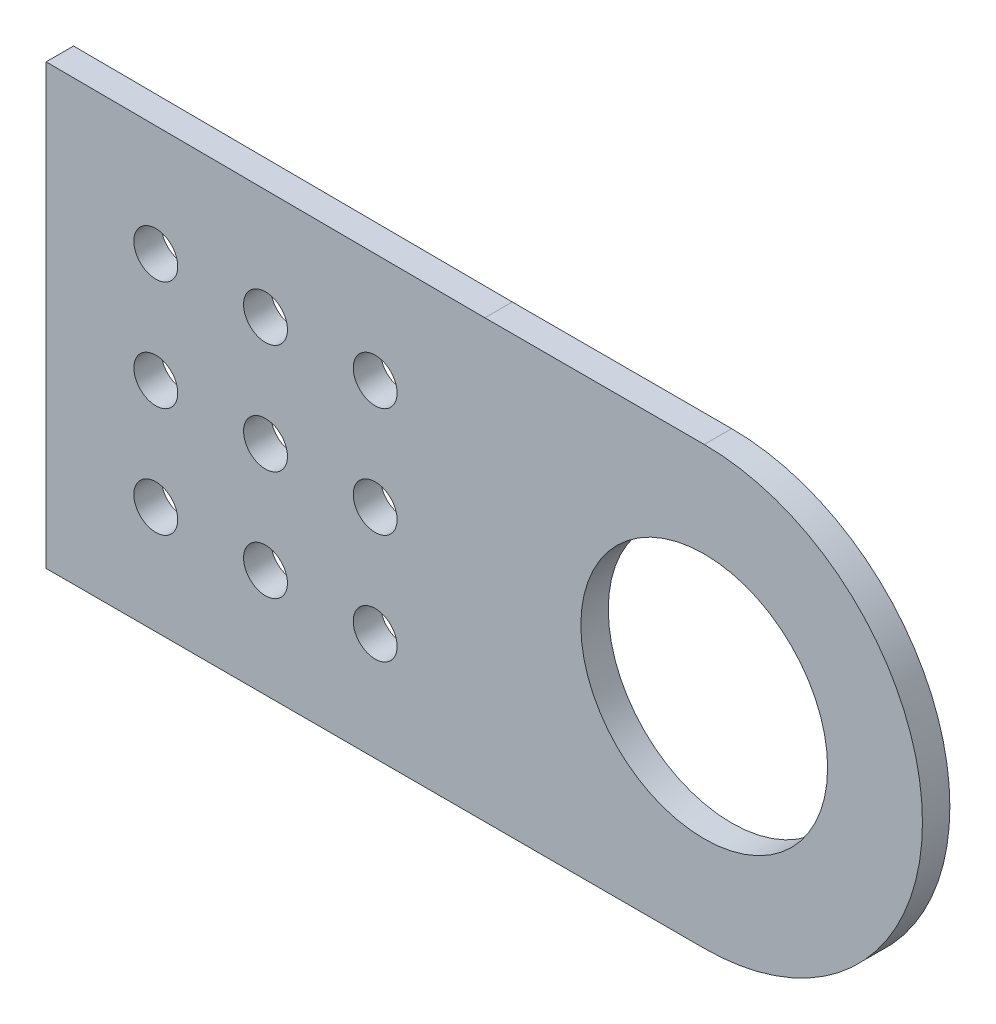
ISO-10303-21;
HEADER;
FILE_DESCRIPTION(('STEP AP214'),'2;1');
FILE_NAME('part.step','',(''),(''),'','','');
FILE_SCHEMA(('AUTOMOTIVE_DESIGN { 1 0 10303 214 1 1 1 1 }'));
ENDSEC;
DATA;
#1=APPLICATION_CONTEXT('core data for automotive mechanical design processes');
#2=APPLICATION_PROTOCOL_DEFINITION('international standard','automotive_design',2000,#1);
#3=PRODUCT_CONTEXT('',#1,'mechanical');
#4=PRODUCT('Part','Part','',(#3));
#5=PRODUCT_RELATED_PRODUCT_CATEGORY('part','',(#4));
#6=PRODUCT_DEFINITION_FORMATION('','',#4);
#7=PRODUCT_DEFINITION_CONTEXT('part definition',#1,'design');
#8=PRODUCT_DEFINITION('design','',#6,#7);
#9=PRODUCT_DEFINITION_SHAPE('','',#8);
#10=(LENGTH_UNIT() NAMED_UNIT(*) SI_UNIT(.MILLI.,.METRE.));
#11=(NAMED_UNIT(*) PLANE_ANGLE_UNIT() SI_UNIT($,.RADIAN.));
#12=(NAMED_UNIT(*) SI_UNIT($,.STERADIAN.) SOLID_ANGLE_UNIT());
#13=UNCERTAINTY_MEASURE_WITH_UNIT(LENGTH_MEASURE(1.E-05),#10,'distance_accuracy_value','');
#14=(GEOMETRIC_REPRESENTATION_CONTEXT(3) GLOBAL_UNCERTAINTY_ASSIGNED_CONTEXT((#13)) GLOBAL_UNIT_ASSIGNED_CONTEXT((#10,
#11,#12)) REPRESENTATION_CONTEXT('',''));
#15=CARTESIAN_POINT('',(0.,0.,0.));
#16=DIRECTION('',(0.,0.,1.));
#17=DIRECTION('',(1.,0.,0.));
#18=AXIS2_PLACEMENT_3D('',#15,#16,#17);
#19=CARTESIAN_POINT('',(76.2000000000003,25.2672028725198,3.175));
#20=DIRECTION('',(0.,0.,1.));
#21=DIRECTION('',(1.,0.,0.));
#22=AXIS2_PLACEMENT_3D('',#19,#20,#21);
#23=PLANE('',#22);
#24=CARTESIAN_POINT('',(12.7,12.5006307363727,3.175));
#25=DIRECTION('',(0.,0.,1.));
#26=DIRECTION('',(1.,0.,0.));
#27=AXIS2_PLACEMENT_3D('',#24,#25,#26);
#28=CIRCLE('',#27,2.54);
#29=CARTESIAN_POINT('',(15.24,12.5006307363727,3.175));
#30=VERTEX_POINT('',#29);
#31=EDGE_CURVE('E204',#30,#30,#28,.T.);
#32=ORIENTED_EDGE('',*,*,#31,.F.);
#33=EDGE_LOOP('',(#32));
#34=FACE_BOUND('',#33,.T.);
#35=CARTESIAN_POINT('',(38.1,12.5006307363727,3.175));
#36=DIRECTION('',(0.,0.,1.));
#37=DIRECTION('',(1.,0.,0.));
#38=AXIS2_PLACEMENT_3D('',#35,#36,#37);
#39=CIRCLE('',#38,2.54);
#40=CARTESIAN_POINT('',(40.64,12.5006307363727,3.175));
#41=VERTEX_POINT('',#40);
#42=EDGE_CURVE('E216',#41,#41,#39,.T.);
#43=ORIENTED_EDGE('',*,*,#42,.F.);
#44=EDGE_LOOP('',(#43));
#45=FACE_BOUND('',#44,.T.);
#46=CARTESIAN_POINT('',(38.1,25.2006307363727,3.175));
#47=DIRECTION('',(0.,0.,1.));
#48=DIRECTION('',(1.,0.,0.));
#49=AXIS2_PLACEMENT_3D('',#46,#47,#48);
#50=CIRCLE('',#49,2.54);
#51=CARTESIAN_POINT('',(40.64,25.2006307363727,3.175));
#52=VERTEX_POINT('',#51);
#53=EDGE_CURVE('E228',#52,#52,#50,.T.);
#54=ORIENTED_EDGE('',*,*,#53,.F.);
#55=EDGE_LOOP('',(#54));
#56=FACE_BOUND('',#55,.T.);
#57=CARTESIAN_POINT('',(38.1,37.9006307363727,3.175));
#58=DIRECTION('',(0.,0.,1.));
#59=DIRECTION('',(1.,0.,0.));
#60=AXIS2_PLACEMENT_3D('',#57,#58,#59);
#61=CIRCLE('',#60,2.54);
#62=CARTESIAN_POINT('',(40.64,37.9006307363727,3.175));
#63=VERTEX_POINT('',#62);
#64=EDGE_CURVE('E240',#63,#63,#61,.T.);
#65=ORIENTED_EDGE('',*,*,#64,.F.);
#66=EDGE_LOOP('',(#65));
#67=FACE_BOUND('',#66,.T.);
#68=CARTESIAN_POINT('',(12.7,37.9006307363727,3.175));
#69=DIRECTION('',(0.,0.,1.));
#70=DIRECTION('',(1.,0.,0.));
#71=AXIS2_PLACEMENT_3D('',#68,#69,#70);
#72=CIRCLE('',#71,2.54);
#73=CARTESIAN_POINT('',(15.24,37.9006307363727,3.175));
#74=VERTEX_POINT('',#73);
#75=EDGE_CURVE('E120',#74,#74,#72,.T.);
#76=ORIENTED_EDGE('',*,*,#75,.F.);
#77=EDGE_LOOP('',(#76));
#78=FACE_BOUND('',#77,.T.);
#79=DIRECTION('',(1.,0.,0.));
#80=VECTOR('',#79,1.);
#81=CARTESIAN_POINT('',(0.,0.,3.175));
#82=LINE('',#81,#80);
#83=CARTESIAN_POINT('',(0.,0.,3.175));
#84=VERTEX_POINT('',#83);
#85=CARTESIAN_POINT('',(76.2000000000003,0.,3.175));
#86=VERTEX_POINT('',#85);
#87=EDGE_CURVE('E125',#84,#86,#82,.T.);
#88=ORIENTED_EDGE('',*,*,#87,.T.);
#89=CARTESIAN_POINT('',(76.2000000000003,25.2672028725198,3.175));
#90=DIRECTION('',(0.,0.,1.));
#91=DIRECTION('',(1.,0.,0.));
#92=AXIS2_PLACEMENT_3D('',#89,#90,#91);
#93=CIRCLE('',#92,25.2672028725198);
#94=CARTESIAN_POINT('',(76.2000000000003,50.5344057450396,3.175));
#95=VERTEX_POINT('',#94);
#96=EDGE_CURVE('E92',#86,#95,#93,.T.);
#97=ORIENTED_EDGE('',*,*,#96,.T.);
#98=DIRECTION('',(-1.,0.,0.));
#99=VECTOR('',#98,1.);
#100=CARTESIAN_POINT('',(50.7999999999998,50.5344057450396,3.175));
#101=LINE('',#100,#99);
#102=CARTESIAN_POINT('',(50.7999999999998,50.5344057450396,3.175));
#103=VERTEX_POINT('',#102);
#104=EDGE_CURVE('E96',#95,#103,#101,.T.);
#105=ORIENTED_EDGE('',*,*,#104,.T.);
#106=DIRECTION('',(-0.999986333068121,0.00522816191145203,0.));
#107=VECTOR('',#106,1.);
#108=CARTESIAN_POINT('',(0.,50.8,3.175));
#109=LINE('',#108,#107);
#110=CARTESIAN_POINT('',(0.,50.8,3.175));
#111=VERTEX_POINT('',#110);
#112=EDGE_CURVE('E100',#103,#111,#109,.T.);
#113=ORIENTED_EDGE('',*,*,#112,.T.);
#114=DIRECTION('',(0.,-1.,0.));
#115=VECTOR('',#114,1.);
#116=CARTESIAN_POINT('',(0.,0.,3.175));
#117=LINE('',#116,#115);
#118=EDGE_CURVE('E58',#111,#84,#117,.T.);
#119=ORIENTED_EDGE('',*,*,#118,.T.);
#120=EDGE_LOOP('',(#88,#97,#105,#113,#119));
#121=FACE_BOUND('',#120,.T.);
#122=CARTESIAN_POINT('',(25.4,37.9006307363727,3.175));
#123=DIRECTION('',(0.,0.,1.));
#124=DIRECTION('',(1.,0.,0.));
#125=AXIS2_PLACEMENT_3D('',#122,#123,#124);
#126=CIRCLE('',#125,2.54);
#127=CARTESIAN_POINT('',(27.94,37.9006307363727,3.175));
#128=VERTEX_POINT('',#127);
#129=EDGE_CURVE('E246',#128,#128,#126,.T.);
#130=ORIENTED_EDGE('',*,*,#129,.F.);
#131=EDGE_LOOP('',(#130));
#132=FACE_BOUND('',#131,.T.);
#133=CARTESIAN_POINT('',(25.4,25.2006307363727,3.175));
#134=DIRECTION('',(0.,0.,1.));
#135=DIRECTION('',(1.,0.,0.));
#136=AXIS2_PLACEMENT_3D('',#133,#134,#135);
#137=CIRCLE('',#136,2.54);
#138=CARTESIAN_POINT('',(27.94,25.2006307363727,3.175));
#139=VERTEX_POINT('',#138);
#140=EDGE_CURVE('E234',#139,#139,#137,.T.);
#141=ORIENTED_EDGE('',*,*,#140,.F.);
#142=EDGE_LOOP('',(#141));
#143=FACE_BOUND('',#142,.T.);
#144=CARTESIAN_POINT('',(25.4,12.5006307363727,3.175));
#145=DIRECTION('',(0.,0.,1.));
#146=DIRECTION('',(1.,0.,0.));
#147=AXIS2_PLACEMENT_3D('',#144,#145,#146);
#148=CIRCLE('',#147,2.54);
#149=CARTESIAN_POINT('',(27.94,12.5006307363727,3.175));
#150=VERTEX_POINT('',#149);
#151=EDGE_CURVE('E222',#150,#150,#148,.T.);
#152=ORIENTED_EDGE('',*,*,#151,.F.);
#153=EDGE_LOOP('',(#152));
#154=FACE_BOUND('',#153,.T.);
#155=CARTESIAN_POINT('',(12.7,25.2006307363727,3.175));
#156=DIRECTION('',(0.,0.,1.));
#157=DIRECTION('',(1.,0.,0.));
#158=AXIS2_PLACEMENT_3D('',#155,#156,#157);
#159=CIRCLE('',#158,2.54);
#160=CARTESIAN_POINT('',(15.24,25.2006307363727,3.175));
#161=VERTEX_POINT('',#160);
#162=EDGE_CURVE('E210',#161,#161,#159,.T.);
#163=ORIENTED_EDGE('',*,*,#162,.F.);
#164=EDGE_LOOP('',(#163));
#165=FACE_BOUND('',#164,.T.);
#166=CARTESIAN_POINT('',(76.2000000000003,25.2672028725198,3.175));
#167=DIRECTION('',(0.,0.,1.));
#168=DIRECTION('',(1.,0.,0.));
#169=AXIS2_PLACEMENT_3D('',#166,#167,#168);
#170=CIRCLE('',#169,14.2875);
#171=CARTESIAN_POINT('',(90.4875000000003,25.2672028725198,3.175));
#172=VERTEX_POINT('',#171);
#173=EDGE_CURVE('E195',#172,#172,#170,.T.);
#174=ORIENTED_EDGE('',*,*,#173,.F.);
#175=EDGE_LOOP('',(#174));
#176=FACE_BOUND('',#175,.T.);
#177=ADVANCED_FACE('F41',(#34,#45,#56,#67,#78,#121,#132,#143,#154,#165,#176),#23,.T.);
#178=CARTESIAN_POINT('',(76.2000000000003,25.2672028725198,0.));
#179=DIRECTION('',(0.,0.,1.));
#180=DIRECTION('',(1.,0.,0.));
#181=AXIS2_PLACEMENT_3D('',#178,#179,#180);
#182=PLANE('',#181);
#183=DIRECTION('',(1.,0.,0.));
#184=VECTOR('',#183,1.);
#185=CARTESIAN_POINT('',(0.,0.,0.));
#186=LINE('',#185,#184);
#187=CARTESIAN_POINT('',(0.,0.,0.));
#188=VERTEX_POINT('',#187);
#189=CARTESIAN_POINT('',(76.2000000000003,0.,0.));
#190=VERTEX_POINT('',#189);
#191=EDGE_CURVE('E116',#188,#190,#186,.T.);
#192=ORIENTED_EDGE('',*,*,#191,.F.);
#193=DIRECTION('',(0.,-1.,0.));
#194=VECTOR('',#193,1.);
#195=CARTESIAN_POINT('',(0.,0.,0.));
#196=LINE('',#195,#194);
#197=CARTESIAN_POINT('',(0.,50.8,0.));
#198=VERTEX_POINT('',#197);
#199=EDGE_CURVE('E84',#198,#188,#196,.T.);
#200=ORIENTED_EDGE('',*,*,#199,.F.);
#201=DIRECTION('',(-0.999986333068121,0.00522816191145203,0.));
#202=VECTOR('',#201,1.);
#203=CARTESIAN_POINT('',(0.,50.8,0.));
#204=LINE('',#203,#202);
#205=CARTESIAN_POINT('',(50.7999999999998,50.5344057450396,0.));
#206=VERTEX_POINT('',#205);
#207=EDGE_CURVE('E78',#206,#198,#204,.T.);
#208=ORIENTED_EDGE('',*,*,#207,.F.);
#209=DIRECTION('',(-1.,0.,0.));
#210=VECTOR('',#209,1.);
#211=CARTESIAN_POINT('',(50.7999999999998,50.5344057450396,0.));
#212=LINE('',#211,#210);
#213=CARTESIAN_POINT('',(76.2000000000003,50.5344057450396,0.));
#214=VERTEX_POINT('',#213);
#215=EDGE_CURVE('E107',#214,#206,#212,.T.);
#216=ORIENTED_EDGE('',*,*,#215,.F.);
#217=CARTESIAN_POINT('',(76.2000000000003,25.2672028725198,0.));
#218=DIRECTION('',(0.,0.,1.));
#219=DIRECTION('',(1.,0.,0.));
#220=AXIS2_PLACEMENT_3D('',#217,#218,#219);
#221=CIRCLE('',#220,25.2672028725198);
#222=EDGE_CURVE('E119',#190,#214,#221,.T.);
#223=ORIENTED_EDGE('',*,*,#222,.F.);
#224=EDGE_LOOP('',(#192,#200,#208,#216,#223));
#225=FACE_BOUND('',#224,.T.);
#226=CARTESIAN_POINT('',(12.7,37.9006307363727,0.));
#227=DIRECTION('',(0.,0.,1.));
#228=DIRECTION('',(1.,0.,0.));
#229=AXIS2_PLACEMENT_3D('',#226,#227,#228);
#230=CIRCLE('',#229,2.54);
#231=CARTESIAN_POINT('',(15.24,37.9006307363727,0.));
#232=VERTEX_POINT('',#231);
#233=EDGE_CURVE('E249',#232,#232,#230,.T.);
#234=ORIENTED_EDGE('',*,*,#233,.T.);
#235=EDGE_LOOP('',(#234));
#236=FACE_BOUND('',#235,.T.);
#237=CARTESIAN_POINT('',(25.4,37.9006307363727,0.));
#238=DIRECTION('',(0.,0.,1.));
#239=DIRECTION('',(1.,0.,0.));
#240=AXIS2_PLACEMENT_3D('',#237,#238,#239);
#241=CIRCLE('',#240,2.54);
#242=CARTESIAN_POINT('',(27.94,37.9006307363727,0.));
#243=VERTEX_POINT('',#242);
#244=EDGE_CURVE('E243',#243,#243,#241,.T.);
#245=ORIENTED_EDGE('',*,*,#244,.T.);
#246=EDGE_LOOP('',(#245));
#247=FACE_BOUND('',#246,.T.);
#248=CARTESIAN_POINT('',(38.1,37.9006307363727,0.));
#249=DIRECTION('',(0.,0.,1.));
#250=DIRECTION('',(1.,0.,0.));
#251=AXIS2_PLACEMENT_3D('',#248,#249,#250);
#252=CIRCLE('',#251,2.54);
#253=CARTESIAN_POINT('',(40.64,37.9006307363727,0.));
#254=VERTEX_POINT('',#253);
#255=EDGE_CURVE('E237',#254,#254,#252,.T.);
#256=ORIENTED_EDGE('',*,*,#255,.T.);
#257=EDGE_LOOP('',(#256));
#258=FACE_BOUND('',#257,.T.);
#259=CARTESIAN_POINT('',(25.4,25.2006307363727,0.));
#260=DIRECTION('',(0.,0.,1.));
#261=DIRECTION('',(1.,0.,0.));
#262=AXIS2_PLACEMENT_3D('',#259,#260,#261);
#263=CIRCLE('',#262,2.54);
#264=CARTESIAN_POINT('',(27.94,25.2006307363727,0.));
#265=VERTEX_POINT('',#264);
#266=EDGE_CURVE('E231',#265,#265,#263,.T.);
#267=ORIENTED_EDGE('',*,*,#266,.T.);
#268=EDGE_LOOP('',(#267));
#269=FACE_BOUND('',#268,.T.);
#270=CARTESIAN_POINT('',(38.1,25.2006307363727,0.));
#271=DIRECTION('',(0.,0.,1.));
#272=DIRECTION('',(1.,0.,0.));
#273=AXIS2_PLACEMENT_3D('',#270,#271,#272);
#274=CIRCLE('',#273,2.54);
#275=CARTESIAN_POINT('',(40.64,25.2006307363727,0.));
#276=VERTEX_POINT('',#275);
#277=EDGE_CURVE('E225',#276,#276,#274,.T.);
#278=ORIENTED_EDGE('',*,*,#277,.T.);
#279=EDGE_LOOP('',(#278));
#280=FACE_BOUND('',#279,.T.);
#281=CARTESIAN_POINT('',(25.4,12.5006307363727,0.));
#282=DIRECTION('',(0.,0.,1.));
#283=DIRECTION('',(1.,0.,0.));
#284=AXIS2_PLACEMENT_3D('',#281,#282,#283);
#285=CIRCLE('',#284,2.54);
#286=CARTESIAN_POINT('',(27.94,12.5006307363727,0.));
#287=VERTEX_POINT('',#286);
#288=EDGE_CURVE('E219',#287,#287,#285,.T.);
#289=ORIENTED_EDGE('',*,*,#288,.T.);
#290=EDGE_LOOP('',(#289));
#291=FACE_BOUND('',#290,.T.);
#292=CARTESIAN_POINT('',(38.1,12.5006307363727,0.));
#293=DIRECTION('',(0.,0.,1.));
#294=DIRECTION('',(1.,0.,0.));
#295=AXIS2_PLACEMENT_3D('',#292,#293,#294);
#296=CIRCLE('',#295,2.54);
#297=CARTESIAN_POINT('',(40.64,12.5006307363727,0.));
#298=VERTEX_POINT('',#297);
#299=EDGE_CURVE('E213',#298,#298,#296,.T.);
#300=ORIENTED_EDGE('',*,*,#299,.T.);
#301=EDGE_LOOP('',(#300));
#302=FACE_BOUND('',#301,.T.);
#303=CARTESIAN_POINT('',(12.7,25.2006307363727,0.));
#304=DIRECTION('',(0.,0.,1.));
#305=DIRECTION('',(1.,0.,0.));
#306=AXIS2_PLACEMENT_3D('',#303,#304,#305);
#307=CIRCLE('',#306,2.54);
#308=CARTESIAN_POINT('',(15.24,25.2006307363727,0.));
#309=VERTEX_POINT('',#308);
#310=EDGE_CURVE('E207',#309,#309,#307,.T.);
#311=ORIENTED_EDGE('',*,*,#310,.T.);
#312=EDGE_LOOP('',(#311));
#313=FACE_BOUND('',#312,.T.);
#314=CARTESIAN_POINT('',(12.7,12.5006307363727,0.));
#315=DIRECTION('',(0.,0.,1.));
#316=DIRECTION('',(1.,0.,0.));
#317=AXIS2_PLACEMENT_3D('',#314,#315,#316);
#318=CIRCLE('',#317,2.54);
#319=CARTESIAN_POINT('',(15.24,12.5006307363727,0.));
#320=VERTEX_POINT('',#319);
#321=EDGE_CURVE('E201',#320,#320,#318,.T.);
#322=ORIENTED_EDGE('',*,*,#321,.T.);
#323=EDGE_LOOP('',(#322));
#324=FACE_BOUND('',#323,.T.);
#325=CARTESIAN_POINT('',(76.2000000000003,25.2672028725198,0.));
#326=DIRECTION('',(0.,0.,1.));
#327=DIRECTION('',(1.,0.,0.));
#328=AXIS2_PLACEMENT_3D('',#325,#326,#327);
#329=CIRCLE('',#328,14.2875);
#330=CARTESIAN_POINT('',(90.4875000000003,25.2672028725198,0.));
#331=VERTEX_POINT('',#330);
#332=EDGE_CURVE('E198',#331,#331,#329,.T.);
#333=ORIENTED_EDGE('',*,*,#332,.T.);
#334=EDGE_LOOP('',(#333));
#335=FACE_BOUND('',#334,.T.);
#336=ADVANCED_FACE('F129',(#225,#236,#247,#258,#269,#280,#291,#302,#313,#324,#335),#182,.F.);
#337=CARTESIAN_POINT('',(0.,0.,3.175));
#338=DIRECTION('',(0.,1.,0.));
#339=DIRECTION('',(0.,0.,1.));
#340=AXIS2_PLACEMENT_3D('',#337,#338,#339);
#341=PLANE('',#340);
#342=ORIENTED_EDGE('',*,*,#191,.T.);
#343=DIRECTION('',(0.,0.,-1.));
#344=VECTOR('',#343,1.);
#345=CARTESIAN_POINT('',(76.2000000000003,0.,3.175));
#346=LINE('',#345,#344);
#347=EDGE_CURVE('E11',#86,#190,#346,.T.);
#348=ORIENTED_EDGE('',*,*,#347,.F.);
#349=ORIENTED_EDGE('',*,*,#87,.F.);
#350=DIRECTION('',(0.,0.,-1.));
#351=VECTOR('',#350,1.);
#352=CARTESIAN_POINT('',(0.,0.,3.175));
#353=LINE('',#352,#351);
#354=EDGE_CURVE('E112',#84,#188,#353,.T.);
#355=ORIENTED_EDGE('',*,*,#354,.T.);
#356=EDGE_LOOP('',(#342,#348,#349,#355));
#357=FACE_BOUND('',#356,.T.);
#358=ADVANCED_FACE('F43',(#357),#341,.F.);
#359=CARTESIAN_POINT('',(76.2000000000003,25.2672028725198,3.175));
#360=DIRECTION('',(0.,0.,-1.));
#361=DIRECTION('',(-1.,0.,0.));
#362=AXIS2_PLACEMENT_3D('',#359,#360,#361);
#363=CYLINDRICAL_SURFACE('',#362,25.2672028725198);
#364=ORIENTED_EDGE('',*,*,#222,.T.);
#365=DIRECTION('',(0.,0.,-1.));
#366=VECTOR('',#365,1.);
#367=CARTESIAN_POINT('',(76.2000000000003,50.5344057450396,3.175));
#368=LINE('',#367,#366);
#369=EDGE_CURVE('E50',#95,#214,#368,.T.);
#370=ORIENTED_EDGE('',*,*,#369,.F.);
#371=ORIENTED_EDGE('',*,*,#96,.F.);
#372=ORIENTED_EDGE('',*,*,#347,.T.);
#373=EDGE_LOOP('',(#364,#370,#371,#372));
#374=FACE_BOUND('',#373,.T.);
#375=ADVANCED_FACE('F362',(#374),#363,.T.);
#376=CARTESIAN_POINT('',(50.7999999999998,50.5344057450396,3.175));
#377=DIRECTION('',(0.,-1.,0.));
#378=DIRECTION('',(1.,0.,0.));
#379=AXIS2_PLACEMENT_3D('',#376,#377,#378);
#380=PLANE('',#379);
#381=ORIENTED_EDGE('',*,*,#215,.T.);
#382=DIRECTION('',(0.,0.,-1.));
#383=VECTOR('',#382,1.);
#384=CARTESIAN_POINT('',(50.7999999999998,50.5344057450396,3.175));
#385=LINE('',#384,#383);
#386=EDGE_CURVE('E104',#103,#206,#385,.T.);
#387=ORIENTED_EDGE('',*,*,#386,.F.);
#388=ORIENTED_EDGE('',*,*,#104,.F.);
#389=ORIENTED_EDGE('',*,*,#369,.T.);
#390=EDGE_LOOP('',(#381,#387,#388,#389));
#391=FACE_BOUND('',#390,.T.);
#392=ADVANCED_FACE('F105',(#391),#380,.F.);
#393=CARTESIAN_POINT('',(0.,50.8,3.175));
#394=DIRECTION('',(-0.00522816191145203,-0.999986333068121,0.));
#395=DIRECTION('',(0.999986333068121,-0.00522816191145203,0.));
#396=AXIS2_PLACEMENT_3D('',#393,#394,#395);
#397=PLANE('',#396);
#398=ORIENTED_EDGE('',*,*,#207,.T.);
#399=DIRECTION('',(0.,0.,-1.));
#400=VECTOR('',#399,1.);
#401=CARTESIAN_POINT('',(0.,50.8,3.175));
#402=LINE('',#401,#400);
#403=EDGE_CURVE('E108',#111,#198,#402,.T.);
#404=ORIENTED_EDGE('',*,*,#403,.F.);
#405=ORIENTED_EDGE('',*,*,#112,.F.);
#406=ORIENTED_EDGE('',*,*,#386,.T.);
#407=EDGE_LOOP('',(#398,#404,#405,#406));
#408=FACE_BOUND('',#407,.T.);
#409=ADVANCED_FACE('F110',(#408),#397,.F.);
#410=CARTESIAN_POINT('',(0.,0.,3.175));
#411=DIRECTION('',(1.,0.,0.));
#412=DIRECTION('',(0.,0.,-1.));
#413=AXIS2_PLACEMENT_3D('',#410,#411,#412);
#414=PLANE('',#413);
#415=ORIENTED_EDGE('',*,*,#199,.T.);
#416=ORIENTED_EDGE('',*,*,#354,.F.);
#417=ORIENTED_EDGE('',*,*,#118,.F.);
#418=ORIENTED_EDGE('',*,*,#403,.T.);
#419=EDGE_LOOP('',(#415,#416,#417,#418));
#420=FACE_BOUND('',#419,.T.);
#421=ADVANCED_FACE('F134',(#420),#414,.F.);
#422=CARTESIAN_POINT('',(12.7,37.9006307363727,3.175));
#423=DIRECTION('',(0.,0.,-1.));
#424=DIRECTION('',(-1.,0.,0.));
#425=AXIS2_PLACEMENT_3D('',#422,#423,#424);
#426=CYLINDRICAL_SURFACE('',#425,2.54);
#427=ORIENTED_EDGE('',*,*,#75,.T.);
#428=EDGE_LOOP('',(#427));
#429=FACE_BOUND('',#428,.T.);
#430=ORIENTED_EDGE('',*,*,#233,.F.);
#431=EDGE_LOOP('',(#430));
#432=FACE_BOUND('',#431,.T.);
#433=ADVANCED_FACE('F136',(#429,#432),#426,.F.);
#434=CARTESIAN_POINT('',(25.4,37.9006307363727,3.175));
#435=DIRECTION('',(0.,0.,-1.));
#436=DIRECTION('',(-1.,0.,0.));
#437=AXIS2_PLACEMENT_3D('',#434,#435,#436);
#438=CYLINDRICAL_SURFACE('',#437,2.54);
#439=ORIENTED_EDGE('',*,*,#129,.T.);
#440=EDGE_LOOP('',(#439));
#441=FACE_BOUND('',#440,.T.);
#442=ORIENTED_EDGE('',*,*,#244,.F.);
#443=EDGE_LOOP('',(#442));
#444=FACE_BOUND('',#443,.T.);
#445=ADVANCED_FACE('F142',(#441,#444),#438,.F.);
#446=CARTESIAN_POINT('',(38.1,37.9006307363727,3.175));
#447=DIRECTION('',(0.,0.,-1.));
#448=DIRECTION('',(-1.,0.,0.));
#449=AXIS2_PLACEMENT_3D('',#446,#447,#448);
#450=CYLINDRICAL_SURFACE('',#449,2.54);
#451=ORIENTED_EDGE('',*,*,#64,.T.);
#452=EDGE_LOOP('',(#451));
#453=FACE_BOUND('',#452,.T.);
#454=ORIENTED_EDGE('',*,*,#255,.F.);
#455=EDGE_LOOP('',(#454));
#456=FACE_BOUND('',#455,.T.);
#457=ADVANCED_FACE('F158',(#453,#456),#450,.F.);
#458=CARTESIAN_POINT('',(25.4,25.2006307363727,3.175));
#459=DIRECTION('',(0.,0.,-1.));
#460=DIRECTION('',(-1.,0.,0.));
#461=AXIS2_PLACEMENT_3D('',#458,#459,#460);
#462=CYLINDRICAL_SURFACE('',#461,2.54);
#463=ORIENTED_EDGE('',*,*,#140,.T.);
#464=EDGE_LOOP('',(#463));
#465=FACE_BOUND('',#464,.T.);
#466=ORIENTED_EDGE('',*,*,#266,.F.);
#467=EDGE_LOOP('',(#466));
#468=FACE_BOUND('',#467,.T.);
#469=ADVANCED_FACE('F162',(#465,#468),#462,.F.);
#470=CARTESIAN_POINT('',(38.1,25.2006307363727,3.175));
#471=DIRECTION('',(0.,0.,-1.));
#472=DIRECTION('',(-1.,0.,0.));
#473=AXIS2_PLACEMENT_3D('',#470,#471,#472);
#474=CYLINDRICAL_SURFACE('',#473,2.54);
#475=ORIENTED_EDGE('',*,*,#53,.T.);
#476=EDGE_LOOP('',(#475));
#477=FACE_BOUND('',#476,.T.);
#478=ORIENTED_EDGE('',*,*,#277,.F.);
#479=EDGE_LOOP('',(#478));
#480=FACE_BOUND('',#479,.T.);
#481=ADVANCED_FACE('F166',(#477,#480),#474,.F.);
#482=CARTESIAN_POINT('',(25.4,12.5006307363727,3.175));
#483=DIRECTION('',(0.,0.,-1.));
#484=DIRECTION('',(-1.,0.,0.));
#485=AXIS2_PLACEMENT_3D('',#482,#483,#484);
#486=CYLINDRICAL_SURFACE('',#485,2.54);
#487=ORIENTED_EDGE('',*,*,#151,.T.);
#488=EDGE_LOOP('',(#487));
#489=FACE_BOUND('',#488,.T.);
#490=ORIENTED_EDGE('',*,*,#288,.F.);
#491=EDGE_LOOP('',(#490));
#492=FACE_BOUND('',#491,.T.);
#493=ADVANCED_FACE('F170',(#489,#492),#486,.F.);
#494=CARTESIAN_POINT('',(38.1,12.5006307363727,3.175));
#495=DIRECTION('',(0.,0.,-1.));
#496=DIRECTION('',(-1.,0.,0.));
#497=AXIS2_PLACEMENT_3D('',#494,#495,#496);
#498=CYLINDRICAL_SURFACE('',#497,2.54);
#499=ORIENTED_EDGE('',*,*,#42,.T.);
#500=EDGE_LOOP('',(#499));
#501=FACE_BOUND('',#500,.T.);
#502=ORIENTED_EDGE('',*,*,#299,.F.);
#503=EDGE_LOOP('',(#502));
#504=FACE_BOUND('',#503,.T.);
#505=ADVANCED_FACE('F174',(#501,#504),#498,.F.);
#506=CARTESIAN_POINT('',(12.7,25.2006307363727,3.175));
#507=DIRECTION('',(0.,0.,-1.));
#508=DIRECTION('',(-1.,0.,0.));
#509=AXIS2_PLACEMENT_3D('',#506,#507,#508);
#510=CYLINDRICAL_SURFACE('',#509,2.54);
#511=ORIENTED_EDGE('',*,*,#162,.T.);
#512=EDGE_LOOP('',(#511));
#513=FACE_BOUND('',#512,.T.);
#514=ORIENTED_EDGE('',*,*,#310,.F.);
#515=EDGE_LOOP('',(#514));
#516=FACE_BOUND('',#515,.T.);
#517=ADVANCED_FACE('F178',(#513,#516),#510,.F.);
#518=CARTESIAN_POINT('',(12.7,12.5006307363727,3.175));
#519=DIRECTION('',(0.,0.,-1.));
#520=DIRECTION('',(-1.,0.,0.));
#521=AXIS2_PLACEMENT_3D('',#518,#519,#520);
#522=CYLINDRICAL_SURFACE('',#521,2.54);
#523=ORIENTED_EDGE('',*,*,#31,.T.);
#524=EDGE_LOOP('',(#523));
#525=FACE_BOUND('',#524,.T.);
#526=ORIENTED_EDGE('',*,*,#321,.F.);
#527=EDGE_LOOP('',(#526));
#528=FACE_BOUND('',#527,.T.);
#529=ADVANCED_FACE('F182',(#525,#528),#522,.F.);
#530=CARTESIAN_POINT('',(76.2000000000003,25.2672028725198,3.175));
#531=DIRECTION('',(0.,0.,-1.));
#532=DIRECTION('',(-1.,0.,0.));
#533=AXIS2_PLACEMENT_3D('',#530,#531,#532);
#534=CYLINDRICAL_SURFACE('',#533,14.2875);
#535=ORIENTED_EDGE('',*,*,#173,.T.);
#536=EDGE_LOOP('',(#535));
#537=FACE_BOUND('',#536,.T.);
#538=ORIENTED_EDGE('',*,*,#332,.F.);
#539=EDGE_LOOP('',(#538));
#540=FACE_BOUND('',#539,.T.);
#541=ADVANCED_FACE('F186',(#537,#540),#534,.F.);
#542=CLOSED_SHELL('',(#177,#336,#358,#375,#392,#409,#421,#433,#445,#457,#469,#481,#493,#505,
#517,#529,#541));
#543=MANIFOLD_SOLID_BREP('B2',#542);
#544=ADVANCED_BREP_SHAPE_REPRESENTATION('',(#18,#543),#14);
#545=SHAPE_DEFINITION_REPRESENTATION(#9,#544);
ENDSEC;
END-ISO-10303-21;
